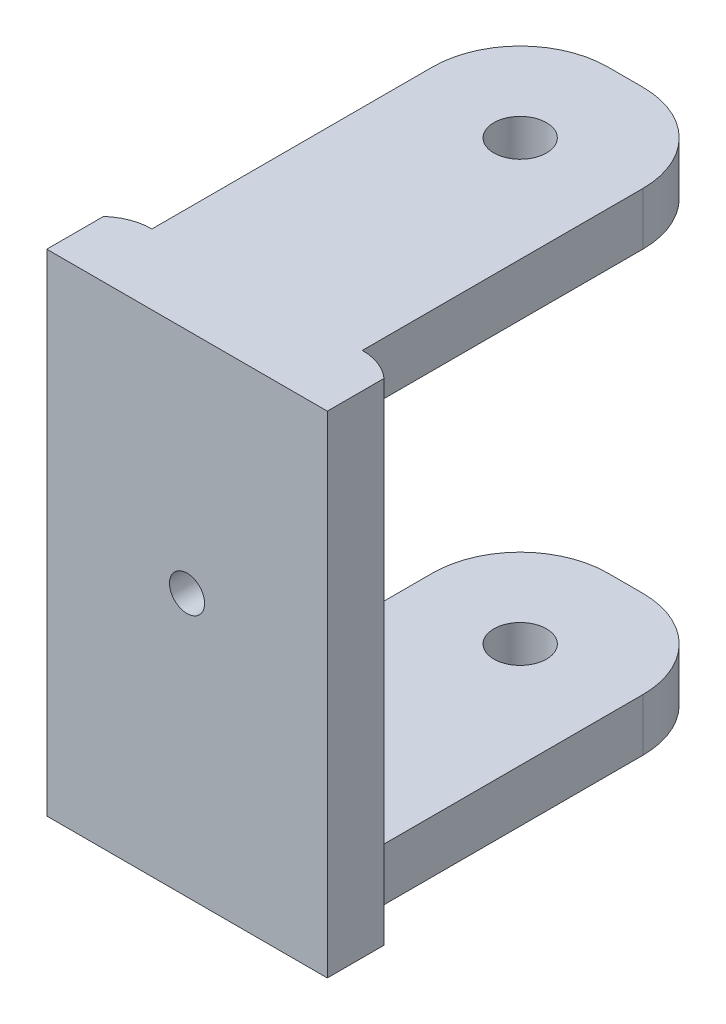
ISO-10303-21;
HEADER;
FILE_DESCRIPTION(('STEP AP214'),'2;1');
FILE_NAME('part.step','',(''),(''),'','','');
FILE_SCHEMA(('AUTOMOTIVE_DESIGN { 1 0 10303 214 1 1 1 1 }'));
ENDSEC;
DATA;
#1=APPLICATION_CONTEXT('core data for automotive mechanical design processes');
#2=APPLICATION_PROTOCOL_DEFINITION('international standard','automotive_design',2000,#1);
#3=PRODUCT_CONTEXT('',#1,'mechanical');
#4=PRODUCT('Part','Part','',(#3));
#5=PRODUCT_RELATED_PRODUCT_CATEGORY('part','',(#4));
#6=PRODUCT_DEFINITION_FORMATION('','',#4);
#7=PRODUCT_DEFINITION_CONTEXT('part definition',#1,'design');
#8=PRODUCT_DEFINITION('design','',#6,#7);
#9=PRODUCT_DEFINITION_SHAPE('','',#8);
#10=(LENGTH_UNIT() NAMED_UNIT(*) SI_UNIT(.MILLI.,.METRE.));
#11=(NAMED_UNIT(*) PLANE_ANGLE_UNIT() SI_UNIT($,.RADIAN.));
#12=(NAMED_UNIT(*) SI_UNIT($,.STERADIAN.) SOLID_ANGLE_UNIT());
#13=UNCERTAINTY_MEASURE_WITH_UNIT(LENGTH_MEASURE(1.E-05),#10,'distance_accuracy_value','');
#14=(GEOMETRIC_REPRESENTATION_CONTEXT(3) GLOBAL_UNCERTAINTY_ASSIGNED_CONTEXT((#13)) GLOBAL_UNIT_ASSIGNED_CONTEXT((#10,
#11,#12)) REPRESENTATION_CONTEXT('',''));
#15=CARTESIAN_POINT('',(0.,0.,0.));
#16=DIRECTION('',(0.,0.,1.));
#17=DIRECTION('',(1.,0.,0.));
#18=AXIS2_PLACEMENT_3D('',#15,#16,#17);
#19=CARTESIAN_POINT('',(-4.02613527547932,0.999999999999997,23.1292718376974));
#20=DIRECTION('',(0.,0.,-1.));
#21=DIRECTION('',(-1.,0.,0.));
#22=AXIS2_PLACEMENT_3D('',#19,#20,#21);
#23=CYLINDRICAL_SURFACE('',#22,1.);
#24=CARTESIAN_POINT('',(-4.02613527547932,0.999999999999997,12.1292718376974));
#25=DIRECTION('',(0.,0.,-1.));
#26=DIRECTION('',(-1.,0.,0.));
#27=AXIS2_PLACEMENT_3D('',#24,#25,#26);
#28=CIRCLE('',#27,1.);
#29=CARTESIAN_POINT('',(-5.02613527547932,0.999999999999997,12.1292718376974));
#30=VERTEX_POINT('',#29);
#31=EDGE_CURVE('E432',#30,#30,#28,.F.);
#32=ORIENTED_EDGE('',*,*,#31,.T.);
#33=EDGE_LOOP('',(#32));
#34=FACE_BOUND('',#33,.T.);
#35=CARTESIAN_POINT('',(-4.02613527547932,0.999999999999997,9.12927183769743));
#36=DIRECTION('',(0.,0.,-1.));
#37=DIRECTION('',(-1.,0.,0.));
#38=AXIS2_PLACEMENT_3D('',#35,#36,#37);
#39=CIRCLE('',#38,1.);
#40=CARTESIAN_POINT('',(-5.02613527547932,0.999999999999997,9.12927183769743));
#41=VERTEX_POINT('',#40);
#42=EDGE_CURVE('E42',#41,#41,#39,.T.);
#43=ORIENTED_EDGE('',*,*,#42,.T.);
#44=EDGE_LOOP('',(#43));
#45=FACE_BOUND('',#44,.T.);
#46=ADVANCED_FACE('F38',(#34,#45),#23,.F.);
#47=CARTESIAN_POINT('',(1.97386472452067,14.,-7.87072816230254));
#48=DIRECTION('',(-1.,0.,0.));
#49=DIRECTION('',(0.,0.,1.));
#50=AXIS2_PLACEMENT_3D('',#47,#48,#49);
#51=PLANE('',#50);
#52=DIRECTION('',(0.,0.,-1.));
#53=VECTOR('',#52,1.);
#54=CARTESIAN_POINT('',(1.97386472452068,11.,8.12927183769743));
#55=LINE('',#54,#53);
#56=CARTESIAN_POINT('',(1.97386472452068,11.,8.12927183769743));
#57=VERTEX_POINT('',#56);
#58=CARTESIAN_POINT('',(1.97386472452067,11.,-7.87072816230257));
#59=VERTEX_POINT('',#58);
#60=EDGE_CURVE('E317',#57,#59,#55,.T.);
#61=ORIENTED_EDGE('',*,*,#60,.T.);
#62=DIRECTION('',(0.,-1.,0.));
#63=VECTOR('',#62,1.);
#64=CARTESIAN_POINT('',(1.97386472452067,14.,-7.87072816230254));
#65=LINE('',#64,#63);
#66=CARTESIAN_POINT('',(1.97386472452067,14.,-7.87072816230254));
#67=VERTEX_POINT('',#66);
#68=EDGE_CURVE('E11',#67,#59,#65,.T.);
#69=ORIENTED_EDGE('',*,*,#68,.F.);
#70=DIRECTION('',(0.,0.,-1.));
#71=VECTOR('',#70,1.);
#72=CARTESIAN_POINT('',(1.97386472452067,14.,-7.87072816230254));
#73=LINE('',#72,#71);
#74=CARTESIAN_POINT('',(1.97386472452068,14.,8.12927183769743));
#75=VERTEX_POINT('',#74);
#76=EDGE_CURVE('E203',#75,#67,#73,.T.);
#77=ORIENTED_EDGE('',*,*,#76,.F.);
#78=DIRECTION('',(0.,-1.,0.));
#79=VECTOR('',#78,1.);
#80=CARTESIAN_POINT('',(1.97386472452068,14.,8.12927183769743));
#81=LINE('',#80,#79);
#82=EDGE_CURVE('E239',#75,#57,#81,.T.);
#83=ORIENTED_EDGE('',*,*,#82,.T.);
#84=EDGE_LOOP('',(#61,#69,#77,#83));
#85=FACE_BOUND('',#84,.T.);
#86=ADVANCED_FACE('F302',(#85),#51,.F.);
#87=CARTESIAN_POINT('',(-3.02613527547933,14.,-7.87072816230257));
#88=DIRECTION('',(0.,-1.,0.));
#89=DIRECTION('',(0.,0.,-1.));
#90=AXIS2_PLACEMENT_3D('',#87,#88,#89);
#91=CYLINDRICAL_SURFACE('',#90,5.);
#92=CARTESIAN_POINT('',(-3.02613527547933,11.,-7.87072816230257));
#93=DIRECTION('',(0.,-1.,0.));
#94=DIRECTION('',(0.,0.,-1.));
#95=AXIS2_PLACEMENT_3D('',#92,#93,#94);
#96=CIRCLE('',#95,5.);
#97=CARTESIAN_POINT('',(-3.02613527547936,11.,-12.8707281623026));
#98=VERTEX_POINT('',#97);
#99=EDGE_CURVE('E272',#98,#59,#96,.T.);
#100=ORIENTED_EDGE('',*,*,#99,.F.);
#101=DIRECTION('',(0.,-1.,0.));
#102=VECTOR('',#101,1.);
#103=CARTESIAN_POINT('',(-3.02613527547936,14.,-12.8707281623026));
#104=LINE('',#103,#102);
#105=CARTESIAN_POINT('',(-3.02613527547936,14.,-12.8707281623026));
#106=VERTEX_POINT('',#105);
#107=EDGE_CURVE('E259',#106,#98,#104,.T.);
#108=ORIENTED_EDGE('',*,*,#107,.F.);
#109=CARTESIAN_POINT('',(-3.02613527547933,14.,-7.87072816230257));
#110=DIRECTION('',(0.,1.,0.));
#111=DIRECTION('',(0.,0.,-1.));
#112=AXIS2_PLACEMENT_3D('',#109,#110,#111);
#113=CIRCLE('',#112,5.);
#114=EDGE_CURVE('E207',#67,#106,#113,.T.);
#115=ORIENTED_EDGE('',*,*,#114,.F.);
#116=ORIENTED_EDGE('',*,*,#68,.T.);
#117=EDGE_LOOP('',(#100,#108,#115,#116));
#118=FACE_BOUND('',#117,.T.);
#119=ADVANCED_FACE('F338',(#118),#91,.T.);
#120=CARTESIAN_POINT('',(-5.02613527547929,14.,-12.8707281623026));
#121=DIRECTION('',(0.,0.,1.));
#122=DIRECTION('',(1.,0.,0.));
#123=AXIS2_PLACEMENT_3D('',#120,#121,#122);
#124=PLANE('',#123);
#125=DIRECTION('',(1.,0.,0.));
#126=VECTOR('',#125,1.);
#127=CARTESIAN_POINT('',(-5.02613527547929,11.,-12.8707281623026));
#128=LINE('',#127,#126);
#129=CARTESIAN_POINT('',(-5.02613527547933,11.,-12.8707281623026));
#130=VERTEX_POINT('',#129);
#131=EDGE_CURVE('E280',#130,#98,#128,.T.);
#132=ORIENTED_EDGE('',*,*,#131,.F.);
#133=DIRECTION('',(0.,-1.,0.));
#134=VECTOR('',#133,1.);
#135=CARTESIAN_POINT('',(-5.02613527547929,14.,-12.8707281623026));
#136=LINE('',#135,#134);
#137=CARTESIAN_POINT('',(-5.02613527547929,14.,-12.8707281623026));
#138=VERTEX_POINT('',#137);
#139=EDGE_CURVE('E254',#138,#130,#136,.T.);
#140=ORIENTED_EDGE('',*,*,#139,.F.);
#141=DIRECTION('',(-1.,0.,0.));
#142=VECTOR('',#141,1.);
#143=CARTESIAN_POINT('',(-5.02613527547929,14.,-12.8707281623026));
#144=LINE('',#143,#142);
#145=EDGE_CURVE('E211',#106,#138,#144,.T.);
#146=ORIENTED_EDGE('',*,*,#145,.F.);
#147=ORIENTED_EDGE('',*,*,#107,.T.);
#148=EDGE_LOOP('',(#132,#140,#146,#147));
#149=FACE_BOUND('',#148,.T.);
#150=ADVANCED_FACE('F330',(#149),#124,.F.);
#151=CARTESIAN_POINT('',(-5.02613527547933,14.,-7.87072816230257));
#152=DIRECTION('',(0.,-1.,0.));
#153=DIRECTION('',(0.,0.,-1.));
#154=AXIS2_PLACEMENT_3D('',#151,#152,#153);
#155=CYLINDRICAL_SURFACE('',#154,5.);
#156=CARTESIAN_POINT('',(-5.02613527547933,11.,-7.87072816230257));
#157=DIRECTION('',(0.,-1.,0.));
#158=DIRECTION('',(0.,0.,-1.));
#159=AXIS2_PLACEMENT_3D('',#156,#157,#158);
#160=CIRCLE('',#159,5.);
#161=CARTESIAN_POINT('',(-10.0261352754793,11.,-7.87072816230253));
#162=VERTEX_POINT('',#161);
#163=EDGE_CURVE('E266',#162,#130,#160,.T.);
#164=ORIENTED_EDGE('',*,*,#163,.F.);
#165=DIRECTION('',(0.,-1.,0.));
#166=VECTOR('',#165,1.);
#167=CARTESIAN_POINT('',(-10.0261352754793,14.,-7.87072816230254));
#168=LINE('',#167,#166);
#169=CARTESIAN_POINT('',(-10.0261352754793,14.,-7.87072816230254));
#170=VERTEX_POINT('',#169);
#171=EDGE_CURVE('E249',#170,#162,#168,.T.);
#172=ORIENTED_EDGE('',*,*,#171,.F.);
#173=CARTESIAN_POINT('',(-5.02613527547933,14.,-7.87072816230257));
#174=DIRECTION('',(0.,1.,0.));
#175=DIRECTION('',(0.,0.,1.));
#176=AXIS2_PLACEMENT_3D('',#173,#174,#175);
#177=CIRCLE('',#176,5.);
#178=EDGE_CURVE('E214',#138,#170,#177,.T.);
#179=ORIENTED_EDGE('',*,*,#178,.F.);
#180=ORIENTED_EDGE('',*,*,#139,.T.);
#181=EDGE_LOOP('',(#164,#172,#179,#180));
#182=FACE_BOUND('',#181,.T.);
#183=ADVANCED_FACE('F334',(#182),#155,.T.);
#184=CARTESIAN_POINT('',(-10.0261352754793,14.,-7.87072816230254));
#185=DIRECTION('',(1.,0.,0.));
#186=DIRECTION('',(0.,0.,-1.));
#187=AXIS2_PLACEMENT_3D('',#184,#185,#186);
#188=PLANE('',#187);
#189=DIRECTION('',(0.,0.,1.));
#190=VECTOR('',#189,1.);
#191=CARTESIAN_POINT('',(-10.0261352754793,11.,8.12927183769743));
#192=LINE('',#191,#190);
#193=CARTESIAN_POINT('',(-10.0261352754793,11.,8.12927183769743));
#194=VERTEX_POINT('',#193);
#195=EDGE_CURVE('E325',#162,#194,#192,.T.);
#196=ORIENTED_EDGE('',*,*,#195,.T.);
#197=DIRECTION('',(0.,-1.,0.));
#198=VECTOR('',#197,1.);
#199=CARTESIAN_POINT('',(-10.0261352754793,14.,8.12927183769743));
#200=LINE('',#199,#198);
#201=CARTESIAN_POINT('',(-10.0261352754793,14.,8.12927183769743));
#202=VERTEX_POINT('',#201);
#203=EDGE_CURVE('E244',#202,#194,#200,.T.);
#204=ORIENTED_EDGE('',*,*,#203,.F.);
#205=DIRECTION('',(0.,0.,1.));
#206=VECTOR('',#205,1.);
#207=CARTESIAN_POINT('',(-10.0261352754793,14.,-7.87072816230254));
#208=LINE('',#207,#206);
#209=EDGE_CURVE('E217',#170,#202,#208,.T.);
#210=ORIENTED_EDGE('',*,*,#209,.F.);
#211=ORIENTED_EDGE('',*,*,#171,.T.);
#212=EDGE_LOOP('',(#196,#204,#210,#211));
#213=FACE_BOUND('',#212,.T.);
#214=ADVANCED_FACE('F395',(#213),#188,.F.);
#215=CARTESIAN_POINT('',(-4.02613527547932,-21.,-6.87072816230257));
#216=DIRECTION('',(0.,1.,0.));
#217=DIRECTION('',(0.,0.,1.));
#218=AXIS2_PLACEMENT_3D('',#215,#216,#217);
#219=CYLINDRICAL_SURFACE('',#218,1.5);
#220=CARTESIAN_POINT('',(-4.02613527547932,14.,-6.87072816230257));
#221=DIRECTION('',(0.,1.,0.));
#222=DIRECTION('',(0.,0.,1.));
#223=AXIS2_PLACEMENT_3D('',#220,#221,#222);
#224=CIRCLE('',#223,1.5);
#225=CARTESIAN_POINT('',(-4.02613527547932,14.,-5.37072816230257));
#226=VERTEX_POINT('',#225);
#227=EDGE_CURVE('E182',#226,#226,#224,.T.);
#228=ORIENTED_EDGE('',*,*,#227,.T.);
#229=EDGE_LOOP('',(#228));
#230=FACE_BOUND('',#229,.T.);
#231=CARTESIAN_POINT('',(-4.02613527547932,11.,-6.87072816230257));
#232=DIRECTION('',(0.,-1.,0.));
#233=DIRECTION('',(0.,0.,-1.));
#234=AXIS2_PLACEMENT_3D('',#231,#232,#233);
#235=CIRCLE('',#234,1.5);
#236=CARTESIAN_POINT('',(-4.02613527547932,11.,-8.37072816230257));
#237=VERTEX_POINT('',#236);
#238=EDGE_CURVE('E263',#237,#237,#235,.F.);
#239=ORIENTED_EDGE('',*,*,#238,.F.);
#240=EDGE_LOOP('',(#239));
#241=FACE_BOUND('',#240,.T.);
#242=ADVANCED_FACE('F384',(#230,#241),#219,.F.);
#243=CARTESIAN_POINT('',(1.97386472452067,-11.,-7.87072816230257));
#244=VERTEX_POINT('',#243);
#245=CARTESIAN_POINT('',(1.97386472452067,-14.,-7.87072816230254));
#246=VERTEX_POINT('',#245);
#247=EDGE_CURVE('E48',#244,#246,#65,.T.);
#248=ORIENTED_EDGE('',*,*,#247,.F.);
#249=DIRECTION('',(0.,0.,-1.));
#250=VECTOR('',#249,1.);
#251=CARTESIAN_POINT('',(1.97386472452068,-11.,8.12927183769743));
#252=LINE('',#251,#250);
#253=CARTESIAN_POINT('',(1.97386472452068,-11.,8.12927183769743));
#254=VERTEX_POINT('',#253);
#255=EDGE_CURVE('E314',#254,#244,#252,.T.);
#256=ORIENTED_EDGE('',*,*,#255,.F.);
#257=CARTESIAN_POINT('',(1.97386472452068,-14.,8.12927183769743));
#258=VERTEX_POINT('',#257);
#259=EDGE_CURVE('E220',#254,#258,#81,.T.);
#260=ORIENTED_EDGE('',*,*,#259,.T.);
#261=DIRECTION('',(0.,0.,-1.));
#262=VECTOR('',#261,1.);
#263=CARTESIAN_POINT('',(1.97386472452067,-14.,-7.87072816230254));
#264=LINE('',#263,#262);
#265=EDGE_CURVE('E202',#258,#246,#264,.T.);
#266=ORIENTED_EDGE('',*,*,#265,.T.);
#267=EDGE_LOOP('',(#248,#256,#260,#266));
#268=FACE_BOUND('',#267,.T.);
#269=ADVANCED_FACE('F40',(#268),#51,.F.);
#270=CARTESIAN_POINT('',(-3.02613527547936,-11.,-12.8707281623026));
#271=VERTEX_POINT('',#270);
#272=CARTESIAN_POINT('',(-3.02613527547936,-14.,-12.8707281623026));
#273=VERTEX_POINT('',#272);
#274=EDGE_CURVE('E258',#271,#273,#104,.T.);
#275=ORIENTED_EDGE('',*,*,#274,.F.);
#276=CARTESIAN_POINT('',(-3.02613527547933,-11.,-7.87072816230257));
#277=DIRECTION('',(0.,-1.,0.));
#278=DIRECTION('',(0.,0.,-1.));
#279=AXIS2_PLACEMENT_3D('',#276,#277,#278);
#280=CIRCLE('',#279,5.);
#281=EDGE_CURVE('E192',#271,#244,#280,.T.);
#282=ORIENTED_EDGE('',*,*,#281,.T.);
#283=ORIENTED_EDGE('',*,*,#247,.T.);
#284=CARTESIAN_POINT('',(-3.02613527547933,-14.,-7.87072816230257));
#285=DIRECTION('',(0.,1.,0.));
#286=DIRECTION('',(0.,0.,-1.));
#287=AXIS2_PLACEMENT_3D('',#284,#285,#286);
#288=CIRCLE('',#287,5.);
#289=EDGE_CURVE('E224',#246,#273,#288,.T.);
#290=ORIENTED_EDGE('',*,*,#289,.T.);
#291=EDGE_LOOP('',(#275,#282,#283,#290));
#292=FACE_BOUND('',#291,.T.);
#293=ADVANCED_FACE('F340',(#292),#91,.T.);
#294=CARTESIAN_POINT('',(-5.02613527547933,-11.,-12.8707281623026));
#295=VERTEX_POINT('',#294);
#296=CARTESIAN_POINT('',(-5.02613527547929,-14.,-12.8707281623026));
#297=VERTEX_POINT('',#296);
#298=EDGE_CURVE('E253',#295,#297,#136,.T.);
#299=ORIENTED_EDGE('',*,*,#298,.F.);
#300=DIRECTION('',(1.,0.,0.));
#301=VECTOR('',#300,1.);
#302=CARTESIAN_POINT('',(-5.02613527547929,-11.,-12.8707281623026));
#303=LINE('',#302,#301);
#304=EDGE_CURVE('E278',#295,#271,#303,.T.);
#305=ORIENTED_EDGE('',*,*,#304,.T.);
#306=ORIENTED_EDGE('',*,*,#274,.T.);
#307=DIRECTION('',(-1.,0.,0.));
#308=VECTOR('',#307,1.);
#309=CARTESIAN_POINT('',(-5.02613527547929,-14.,-12.8707281623026));
#310=LINE('',#309,#308);
#311=EDGE_CURVE('E228',#273,#297,#310,.T.);
#312=ORIENTED_EDGE('',*,*,#311,.T.);
#313=EDGE_LOOP('',(#299,#305,#306,#312));
#314=FACE_BOUND('',#313,.T.);
#315=ADVANCED_FACE('F346',(#314),#124,.F.);
#316=CARTESIAN_POINT('',(-10.0261352754793,-11.,-7.87072816230253));
#317=VERTEX_POINT('',#316);
#318=CARTESIAN_POINT('',(-10.0261352754793,-14.,-7.87072816230254));
#319=VERTEX_POINT('',#318);
#320=EDGE_CURVE('E248',#317,#319,#168,.T.);
#321=ORIENTED_EDGE('',*,*,#320,.F.);
#322=CARTESIAN_POINT('',(-5.02613527547933,-11.,-7.87072816230257));
#323=DIRECTION('',(0.,-1.,0.));
#324=DIRECTION('',(0.,0.,-1.));
#325=AXIS2_PLACEMENT_3D('',#322,#323,#324);
#326=CIRCLE('',#325,5.);
#327=EDGE_CURVE('E271',#317,#295,#326,.T.);
#328=ORIENTED_EDGE('',*,*,#327,.T.);
#329=ORIENTED_EDGE('',*,*,#298,.T.);
#330=CARTESIAN_POINT('',(-5.02613527547933,-14.,-7.87072816230257));
#331=DIRECTION('',(0.,1.,0.));
#332=DIRECTION('',(0.,0.,1.));
#333=AXIS2_PLACEMENT_3D('',#330,#331,#332);
#334=CIRCLE('',#333,5.);
#335=EDGE_CURVE('E232',#297,#319,#334,.T.);
#336=ORIENTED_EDGE('',*,*,#335,.T.);
#337=EDGE_LOOP('',(#321,#328,#329,#336));
#338=FACE_BOUND('',#337,.T.);
#339=ADVANCED_FACE('F393',(#338),#155,.T.);
#340=CARTESIAN_POINT('',(-10.0261352754793,-11.,8.12927183769743));
#341=VERTEX_POINT('',#340);
#342=CARTESIAN_POINT('',(-10.0261352754793,-14.,8.12927183769743));
#343=VERTEX_POINT('',#342);
#344=EDGE_CURVE('E243',#341,#343,#200,.T.);
#345=ORIENTED_EDGE('',*,*,#344,.F.);
#346=DIRECTION('',(0.,0.,1.));
#347=VECTOR('',#346,1.);
#348=CARTESIAN_POINT('',(-10.0261352754793,-11.,8.12927183769743));
#349=LINE('',#348,#347);
#350=EDGE_CURVE('E426',#317,#341,#349,.T.);
#351=ORIENTED_EDGE('',*,*,#350,.F.);
#352=ORIENTED_EDGE('',*,*,#320,.T.);
#353=DIRECTION('',(0.,0.,1.));
#354=VECTOR('',#353,1.);
#355=CARTESIAN_POINT('',(-10.0261352754793,-14.,-7.87072816230254));
#356=LINE('',#355,#354);
#357=EDGE_CURVE('E208',#319,#343,#356,.T.);
#358=ORIENTED_EDGE('',*,*,#357,.T.);
#359=EDGE_LOOP('',(#345,#351,#352,#358));
#360=FACE_BOUND('',#359,.T.);
#361=ADVANCED_FACE('F387',(#360),#188,.F.);
#362=CARTESIAN_POINT('',(-5.02613527547933,14.,-7.87072816230257));
#363=DIRECTION('',(0.,1.,0.));
#364=DIRECTION('',(0.,0.,1.));
#365=AXIS2_PLACEMENT_3D('',#362,#363,#364);
#366=PLANE('',#365);
#367=DIRECTION('',(0.,0.,1.));
#368=VECTOR('',#367,1.);
#369=CARTESIAN_POINT('',(-12.0261352754793,14.,2.12927183769743));
#370=LINE('',#369,#368);
#371=CARTESIAN_POINT('',(-12.0261352754793,14.,8.89320386019764));
#372=VERTEX_POINT('',#371);
#373=CARTESIAN_POINT('',(-12.0261352754793,14.,12.1292718376974));
#374=VERTEX_POINT('',#373);
#375=EDGE_CURVE('E154',#372,#374,#370,.T.);
#376=ORIENTED_EDGE('',*,*,#375,.T.);
#377=DIRECTION('',(1.,0.,0.));
#378=VECTOR('',#377,1.);
#379=CARTESIAN_POINT('',(-13.0261352754793,14.,12.1292718376974));
#380=LINE('',#379,#378);
#381=CARTESIAN_POINT('',(3.97386472452068,14.,12.1292718376974));
#382=VERTEX_POINT('',#381);
#383=EDGE_CURVE('E168',#374,#382,#380,.T.);
#384=ORIENTED_EDGE('',*,*,#383,.T.);
#385=DIRECTION('',(0.,0.,1.));
#386=VECTOR('',#385,1.);
#387=CARTESIAN_POINT('',(3.97386472452067,14.,2.12927183769743));
#388=LINE('',#387,#386);
#389=CARTESIAN_POINT('',(3.97386472452067,14.,8.89320386019764));
#390=VERTEX_POINT('',#389);
#391=EDGE_CURVE('E56',#390,#382,#388,.T.);
#392=ORIENTED_EDGE('',*,*,#391,.F.);
#393=CARTESIAN_POINT('',(1.97386472452068,14.,11.1292718376974));
#394=DIRECTION('',(0.,1.,0.));
#395=DIRECTION('',(0.,0.,-1.));
#396=AXIS2_PLACEMENT_3D('',#393,#394,#395);
#397=CIRCLE('',#396,3.);
#398=EDGE_CURVE('E184',#390,#75,#397,.T.);
#399=ORIENTED_EDGE('',*,*,#398,.T.);
#400=ORIENTED_EDGE('',*,*,#76,.T.);
#401=ORIENTED_EDGE('',*,*,#114,.T.);
#402=ORIENTED_EDGE('',*,*,#145,.T.);
#403=ORIENTED_EDGE('',*,*,#178,.T.);
#404=ORIENTED_EDGE('',*,*,#209,.T.);
#405=CARTESIAN_POINT('',(-10.0261352754793,14.,11.1292718376974));
#406=DIRECTION('',(0.,1.,0.));
#407=DIRECTION('',(0.,0.,1.));
#408=AXIS2_PLACEMENT_3D('',#405,#406,#407);
#409=CIRCLE('',#408,3.);
#410=EDGE_CURVE('E170',#202,#372,#409,.T.);
#411=ORIENTED_EDGE('',*,*,#410,.T.);
#412=EDGE_LOOP('',(#376,#384,#392,#399,#400,#401,#402,#403,#404,#411));
#413=FACE_BOUND('',#412,.T.);
#414=ORIENTED_EDGE('',*,*,#227,.F.);
#415=EDGE_LOOP('',(#414));
#416=FACE_BOUND('',#415,.T.);
#417=ADVANCED_FACE('F166',(#413,#416),#366,.T.);
#418=CARTESIAN_POINT('',(-5.02613527547933,-14.,-7.87072816230257));
#419=DIRECTION('',(0.,1.,0.));
#420=DIRECTION('',(0.,0.,1.));
#421=AXIS2_PLACEMENT_3D('',#418,#419,#420);
#422=PLANE('',#421);
#423=CARTESIAN_POINT('',(-4.02613527547932,-14.,-6.87072816230257));
#424=DIRECTION('',(0.,1.,0.));
#425=DIRECTION('',(0.,0.,1.));
#426=AXIS2_PLACEMENT_3D('',#423,#424,#425);
#427=CIRCLE('',#426,1.5);
#428=CARTESIAN_POINT('',(-4.02613527547932,-14.,-5.37072816230257));
#429=VERTEX_POINT('',#428);
#430=EDGE_CURVE('E177',#429,#429,#427,.T.);
#431=ORIENTED_EDGE('',*,*,#430,.T.);
#432=EDGE_LOOP('',(#431));
#433=FACE_BOUND('',#432,.T.);
#434=DIRECTION('',(1.,0.,0.));
#435=VECTOR('',#434,1.);
#436=CARTESIAN_POINT('',(-13.0261352754793,-14.,12.1292718376974));
#437=LINE('',#436,#435);
#438=CARTESIAN_POINT('',(-12.0261352754793,-14.,12.1292718376974));
#439=VERTEX_POINT('',#438);
#440=CARTESIAN_POINT('',(3.97386472452068,-14.,12.1292718376974));
#441=VERTEX_POINT('',#440);
#442=EDGE_CURVE('E196',#439,#441,#437,.T.);
#443=ORIENTED_EDGE('',*,*,#442,.F.);
#444=DIRECTION('',(0.,0.,1.));
#445=VECTOR('',#444,1.);
#446=CARTESIAN_POINT('',(-12.0261352754793,-14.,2.12927183769743));
#447=LINE('',#446,#445);
#448=CARTESIAN_POINT('',(-12.0261352754793,-14.,8.89320386019764));
#449=VERTEX_POINT('',#448);
#450=EDGE_CURVE('E64',#449,#439,#447,.T.);
#451=ORIENTED_EDGE('',*,*,#450,.F.);
#452=CARTESIAN_POINT('',(-10.0261352754793,-14.,11.1292718376974));
#453=DIRECTION('',(0.,1.,0.));
#454=DIRECTION('',(0.,0.,1.));
#455=AXIS2_PLACEMENT_3D('',#452,#453,#454);
#456=CIRCLE('',#455,3.);
#457=EDGE_CURVE('E191',#343,#449,#456,.T.);
#458=ORIENTED_EDGE('',*,*,#457,.F.);
#459=ORIENTED_EDGE('',*,*,#357,.F.);
#460=ORIENTED_EDGE('',*,*,#335,.F.);
#461=ORIENTED_EDGE('',*,*,#311,.F.);
#462=ORIENTED_EDGE('',*,*,#289,.F.);
#463=ORIENTED_EDGE('',*,*,#265,.F.);
#464=CARTESIAN_POINT('',(1.97386472452068,-14.,11.1292718376974));
#465=DIRECTION('',(0.,1.,0.));
#466=DIRECTION('',(0.,0.,-1.));
#467=AXIS2_PLACEMENT_3D('',#464,#465,#466);
#468=CIRCLE('',#467,3.);
#469=CARTESIAN_POINT('',(3.97386472452068,-14.,8.89320386019764));
#470=VERTEX_POINT('',#469);
#471=EDGE_CURVE('E188',#470,#258,#468,.T.);
#472=ORIENTED_EDGE('',*,*,#471,.F.);
#473=DIRECTION('',(0.,0.,1.));
#474=VECTOR('',#473,1.);
#475=CARTESIAN_POINT('',(3.97386472452068,-14.,2.12927183769743));
#476=LINE('',#475,#474);
#477=EDGE_CURVE('E161',#470,#441,#476,.T.);
#478=ORIENTED_EDGE('',*,*,#477,.T.);
#479=EDGE_LOOP('',(#443,#451,#458,#459,#460,#461,#462,#463,#472,#478));
#480=FACE_BOUND('',#479,.T.);
#481=ADVANCED_FACE('F383',(#433,#480),#422,.F.);
#482=CARTESIAN_POINT('',(-4.02613527547932,-11.,-6.87072816230257));
#483=DIRECTION('',(0.,-1.,0.));
#484=DIRECTION('',(0.,0.,-1.));
#485=AXIS2_PLACEMENT_3D('',#482,#483,#484);
#486=CIRCLE('',#485,1.5);
#487=CARTESIAN_POINT('',(-4.02613527547932,-11.,-8.37072816230257));
#488=VERTEX_POINT('',#487);
#489=EDGE_CURVE('E268',#488,#488,#486,.F.);
#490=ORIENTED_EDGE('',*,*,#489,.T.);
#491=EDGE_LOOP('',(#490));
#492=FACE_BOUND('',#491,.T.);
#493=ORIENTED_EDGE('',*,*,#430,.F.);
#494=EDGE_LOOP('',(#493));
#495=FACE_BOUND('',#494,.T.);
#496=ADVANCED_FACE('F380',(#492,#495),#219,.F.);
#497=CARTESIAN_POINT('',(1.97386472452068,14.,11.1292718376974));
#498=DIRECTION('',(0.,-1.,0.));
#499=DIRECTION('',(0.,0.,-1.));
#500=AXIS2_PLACEMENT_3D('',#497,#498,#499);
#501=CYLINDRICAL_SURFACE('',#500,3.);
#502=ORIENTED_EDGE('',*,*,#398,.F.);
#503=DIRECTION('',(0.,-1.,0.));
#504=VECTOR('',#503,1.);
#505=CARTESIAN_POINT('',(3.97386472452067,14.,8.89320386019764));
#506=LINE('',#505,#504);
#507=EDGE_CURVE('E172',#390,#470,#506,.T.);
#508=ORIENTED_EDGE('',*,*,#507,.T.);
#509=ORIENTED_EDGE('',*,*,#471,.T.);
#510=ORIENTED_EDGE('',*,*,#259,.F.);
#511=DIRECTION('',(0.,1.,0.));
#512=VECTOR('',#511,1.);
#513=CARTESIAN_POINT('',(1.97386472452068,-11.,8.12927183769743));
#514=LINE('',#513,#512);
#515=EDGE_CURVE('E267',#254,#57,#514,.T.);
#516=ORIENTED_EDGE('',*,*,#515,.T.);
#517=ORIENTED_EDGE('',*,*,#82,.F.);
#518=EDGE_LOOP('',(#502,#508,#509,#510,#516,#517));
#519=FACE_BOUND('',#518,.T.);
#520=ADVANCED_FACE('F304',(#519),#501,.T.);
#521=CARTESIAN_POINT('',(-10.0261352754793,14.,11.1292718376974));
#522=DIRECTION('',(0.,-1.,0.));
#523=DIRECTION('',(0.,0.,-1.));
#524=AXIS2_PLACEMENT_3D('',#521,#522,#523);
#525=CYLINDRICAL_SURFACE('',#524,3.);
#526=ORIENTED_EDGE('',*,*,#457,.T.);
#527=DIRECTION('',(0.,-1.,0.));
#528=VECTOR('',#527,1.);
#529=CARTESIAN_POINT('',(-12.0261352754793,14.,8.89320386019764));
#530=LINE('',#529,#528);
#531=EDGE_CURVE('E446',#449,#372,#530,.F.);
#532=ORIENTED_EDGE('',*,*,#531,.T.);
#533=ORIENTED_EDGE('',*,*,#410,.F.);
#534=ORIENTED_EDGE('',*,*,#203,.T.);
#535=DIRECTION('',(0.,1.,0.));
#536=VECTOR('',#535,1.);
#537=CARTESIAN_POINT('',(-10.0261352754793,-11.,8.12927183769743));
#538=LINE('',#537,#536);
#539=EDGE_CURVE('E311',#341,#194,#538,.T.);
#540=ORIENTED_EDGE('',*,*,#539,.F.);
#541=ORIENTED_EDGE('',*,*,#344,.T.);
#542=EDGE_LOOP('',(#526,#532,#533,#534,#540,#541));
#543=FACE_BOUND('',#542,.T.);
#544=ADVANCED_FACE('F373',(#543),#525,.T.);
#545=CARTESIAN_POINT('',(-13.0261352754793,14.,12.1292718376974));
#546=DIRECTION('',(0.,0.,-1.));
#547=DIRECTION('',(-1.,0.,0.));
#548=AXIS2_PLACEMENT_3D('',#545,#546,#547);
#549=PLANE('',#548);
#550=ORIENTED_EDGE('',*,*,#31,.F.);
#551=EDGE_LOOP('',(#550));
#552=FACE_BOUND('',#551,.T.);
#553=ORIENTED_EDGE('',*,*,#383,.F.);
#554=DIRECTION('',(0.,1.,0.));
#555=VECTOR('',#554,1.);
#556=CARTESIAN_POINT('',(-12.0261352754793,14.,12.1292718376974));
#557=LINE('',#556,#555);
#558=EDGE_CURVE('E151',#439,#374,#557,.T.);
#559=ORIENTED_EDGE('',*,*,#558,.F.);
#560=ORIENTED_EDGE('',*,*,#442,.T.);
#561=DIRECTION('',(0.,-1.,0.));
#562=VECTOR('',#561,1.);
#563=CARTESIAN_POINT('',(3.97386472452067,14.,12.1292718376974));
#564=LINE('',#563,#562);
#565=EDGE_CURVE('E175',#382,#441,#564,.T.);
#566=ORIENTED_EDGE('',*,*,#565,.F.);
#567=EDGE_LOOP('',(#553,#559,#560,#566));
#568=FACE_BOUND('',#567,.T.);
#569=ADVANCED_FACE('F174',(#552,#568),#549,.F.);
#570=CARTESIAN_POINT('',(0.,-11.,0.));
#571=DIRECTION('',(0.,-1.,0.));
#572=DIRECTION('',(0.,0.,-1.));
#573=AXIS2_PLACEMENT_3D('',#570,#571,#572);
#574=PLANE('',#573);
#575=ORIENTED_EDGE('',*,*,#489,.F.);
#576=EDGE_LOOP('',(#575));
#577=FACE_BOUND('',#576,.T.);
#578=ORIENTED_EDGE('',*,*,#304,.F.);
#579=ORIENTED_EDGE('',*,*,#327,.F.);
#580=ORIENTED_EDGE('',*,*,#350,.T.);
#581=DIRECTION('',(1.,0.,0.));
#582=VECTOR('',#581,1.);
#583=CARTESIAN_POINT('',(-10.0261352754793,-11.,8.12927183769743));
#584=LINE('',#583,#582);
#585=EDGE_CURVE('E422',#341,#254,#584,.T.);
#586=ORIENTED_EDGE('',*,*,#585,.T.);
#587=ORIENTED_EDGE('',*,*,#255,.T.);
#588=ORIENTED_EDGE('',*,*,#281,.F.);
#589=EDGE_LOOP('',(#578,#579,#580,#586,#587,#588));
#590=FACE_BOUND('',#589,.T.);
#591=ADVANCED_FACE('F360',(#577,#590),#574,.F.);
#592=CARTESIAN_POINT('',(0.,11.,0.));
#593=DIRECTION('',(0.,-1.,0.));
#594=DIRECTION('',(0.,0.,-1.));
#595=AXIS2_PLACEMENT_3D('',#592,#593,#594);
#596=PLANE('',#595);
#597=ORIENTED_EDGE('',*,*,#238,.T.);
#598=EDGE_LOOP('',(#597));
#599=FACE_BOUND('',#598,.T.);
#600=ORIENTED_EDGE('',*,*,#99,.T.);
#601=ORIENTED_EDGE('',*,*,#60,.F.);
#602=DIRECTION('',(1.,0.,0.));
#603=VECTOR('',#602,1.);
#604=CARTESIAN_POINT('',(-10.0261352754793,11.,8.12927183769743));
#605=LINE('',#604,#603);
#606=EDGE_CURVE('E431',#194,#57,#605,.T.);
#607=ORIENTED_EDGE('',*,*,#606,.F.);
#608=ORIENTED_EDGE('',*,*,#195,.F.);
#609=ORIENTED_EDGE('',*,*,#163,.T.);
#610=ORIENTED_EDGE('',*,*,#131,.T.);
#611=EDGE_LOOP('',(#600,#601,#607,#608,#609,#610));
#612=FACE_BOUND('',#611,.T.);
#613=ADVANCED_FACE('F322',(#599,#612),#596,.T.);
#614=CARTESIAN_POINT('',(-10.0261352754793,-11.,8.12927183769743));
#615=DIRECTION('',(0.,0.,1.));
#616=DIRECTION('',(1.,0.,0.));
#617=AXIS2_PLACEMENT_3D('',#614,#615,#616);
#618=PLANE('',#617);
#619=CARTESIAN_POINT('',(-4.02613527547932,0.999999999999997,8.12927183769743));
#620=DIRECTION('',(0.,0.,-1.));
#621=DIRECTION('',(-1.,0.,0.));
#622=AXIS2_PLACEMENT_3D('',#619,#620,#621);
#623=CIRCLE('',#622,2.);
#624=CARTESIAN_POINT('',(-6.02613527547932,0.999999999999997,8.12927183769743));
#625=VERTEX_POINT('',#624);
#626=EDGE_CURVE('E441',#625,#625,#623,.T.);
#627=ORIENTED_EDGE('',*,*,#626,.F.);
#628=EDGE_LOOP('',(#627));
#629=FACE_BOUND('',#628,.T.);
#630=ORIENTED_EDGE('',*,*,#606,.T.);
#631=ORIENTED_EDGE('',*,*,#515,.F.);
#632=ORIENTED_EDGE('',*,*,#585,.F.);
#633=ORIENTED_EDGE('',*,*,#539,.T.);
#634=EDGE_LOOP('',(#630,#631,#632,#633));
#635=FACE_BOUND('',#634,.T.);
#636=ADVANCED_FACE('F366',(#629,#635),#618,.F.);
#637=CARTESIAN_POINT('',(-4.02613527547932,0.999999999999997,9.12927183769743));
#638=DIRECTION('',(0.,0.,-1.));
#639=DIRECTION('',(-1.,0.,0.));
#640=AXIS2_PLACEMENT_3D('',#637,#638,#639);
#641=CYLINDRICAL_SURFACE('',#640,2.);
#642=CARTESIAN_POINT('',(-4.02613527547932,0.999999999999997,9.12927183769743));
#643=DIRECTION('',(0.,0.,-1.));
#644=DIRECTION('',(-1.,0.,0.));
#645=AXIS2_PLACEMENT_3D('',#642,#643,#644);
#646=CIRCLE('',#645,2.);
#647=CARTESIAN_POINT('',(-6.02613527547932,0.999999999999997,9.12927183769743));
#648=VERTEX_POINT('',#647);
#649=EDGE_CURVE('E445',#648,#648,#646,.T.);
#650=ORIENTED_EDGE('',*,*,#649,.F.);
#651=EDGE_LOOP('',(#650));
#652=FACE_BOUND('',#651,.T.);
#653=ORIENTED_EDGE('',*,*,#626,.T.);
#654=EDGE_LOOP('',(#653));
#655=FACE_BOUND('',#654,.T.);
#656=ADVANCED_FACE('F358',(#652,#655),#641,.F.);
#657=CARTESIAN_POINT('',(-4.02613527547932,0.999999999999997,9.12927183769743));
#658=DIRECTION('',(0.,0.,-1.));
#659=DIRECTION('',(-1.,0.,0.));
#660=AXIS2_PLACEMENT_3D('',#657,#658,#659);
#661=PLANE('',#660);
#662=ORIENTED_EDGE('',*,*,#42,.F.);
#663=EDGE_LOOP('',(#662));
#664=FACE_BOUND('',#663,.T.);
#665=ORIENTED_EDGE('',*,*,#649,.T.);
#666=EDGE_LOOP('',(#665));
#667=FACE_BOUND('',#666,.T.);
#668=ADVANCED_FACE('F465',(#664,#667),#661,.T.);
#669=CARTESIAN_POINT('',(3.97386472452067,14.,2.12927183769743));
#670=DIRECTION('',(-1.,0.,0.));
#671=DIRECTION('',(0.,-1.,0.));
#672=AXIS2_PLACEMENT_3D('',#669,#670,#671);
#673=PLANE('',#672);
#674=ORIENTED_EDGE('',*,*,#391,.T.);
#675=ORIENTED_EDGE('',*,*,#565,.T.);
#676=ORIENTED_EDGE('',*,*,#477,.F.);
#677=ORIENTED_EDGE('',*,*,#507,.F.);
#678=EDGE_LOOP('',(#674,#675,#676,#677));
#679=FACE_BOUND('',#678,.T.);
#680=ADVANCED_FACE('F468',(#679),#673,.F.);
#681=CARTESIAN_POINT('',(-12.0261352754793,14.,2.12927183769743));
#682=DIRECTION('',(1.,0.,0.));
#683=DIRECTION('',(0.,1.,0.));
#684=AXIS2_PLACEMENT_3D('',#681,#682,#683);
#685=PLANE('',#684);
#686=ORIENTED_EDGE('',*,*,#450,.T.);
#687=ORIENTED_EDGE('',*,*,#558,.T.);
#688=ORIENTED_EDGE('',*,*,#375,.F.);
#689=ORIENTED_EDGE('',*,*,#531,.F.);
#690=EDGE_LOOP('',(#686,#687,#688,#689));
#691=FACE_BOUND('',#690,.T.);
#692=ADVANCED_FACE('F153',(#691),#685,.F.);
#693=CLOSED_SHELL('',(#46,#86,#119,#150,#183,#214,#242,#269,#293,#315,#339,#361,#417,#481,#496,
#520,#544,#569,#591,#613,#636,#656,#668,#680,#692));
#694=MANIFOLD_SOLID_BREP('B2',#693);
#695=ADVANCED_BREP_SHAPE_REPRESENTATION('',(#18,#694),#14);
#696=SHAPE_DEFINITION_REPRESENTATION(#9,#695);
ENDSEC;
END-ISO-10303-21;
